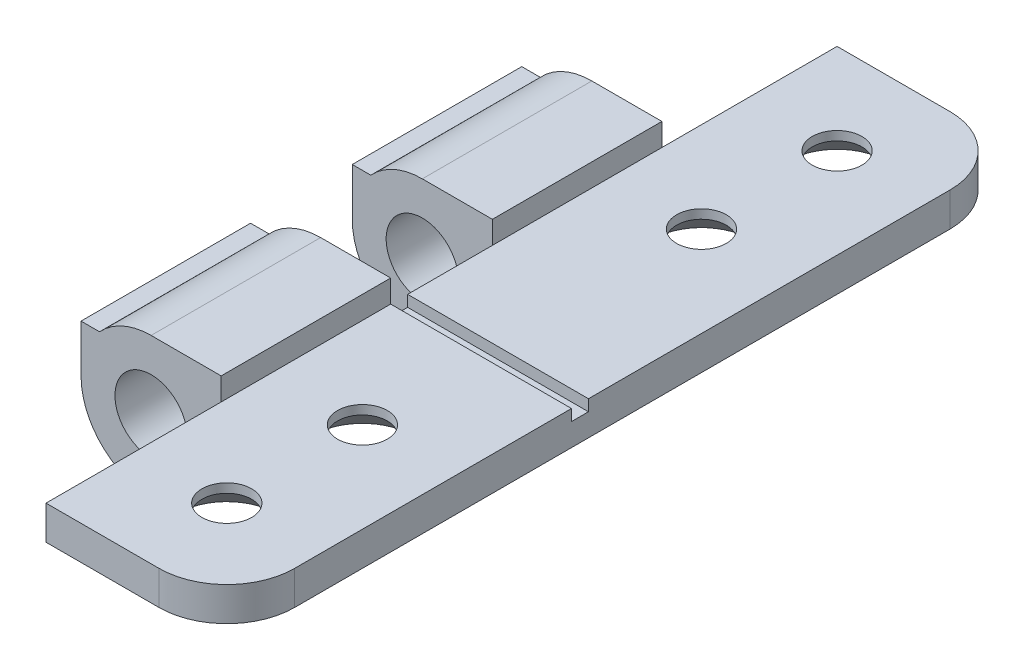
ISO-10303-21;
HEADER;
FILE_DESCRIPTION(('STEP AP214'),'2;1');
FILE_NAME('part.step','',(''),(''),'','','');
FILE_SCHEMA(('AUTOMOTIVE_DESIGN { 1 0 10303 214 1 1 1 1 }'));
ENDSEC;
DATA;
#1=APPLICATION_CONTEXT('core data for automotive mechanical design processes');
#2=APPLICATION_PROTOCOL_DEFINITION('international standard','automotive_design',2000,#1);
#3=PRODUCT_CONTEXT('',#1,'mechanical');
#4=PRODUCT('Part','Part','',(#3));
#5=PRODUCT_RELATED_PRODUCT_CATEGORY('part','',(#4));
#6=PRODUCT_DEFINITION_FORMATION('','',#4);
#7=PRODUCT_DEFINITION_CONTEXT('part definition',#1,'design');
#8=PRODUCT_DEFINITION('design','',#6,#7);
#9=PRODUCT_DEFINITION_SHAPE('','',#8);
#10=(LENGTH_UNIT() NAMED_UNIT(*) SI_UNIT(.MILLI.,.METRE.));
#11=(NAMED_UNIT(*) PLANE_ANGLE_UNIT() SI_UNIT($,.RADIAN.));
#12=(NAMED_UNIT(*) SI_UNIT($,.STERADIAN.) SOLID_ANGLE_UNIT());
#13=UNCERTAINTY_MEASURE_WITH_UNIT(LENGTH_MEASURE(1.E-05),#10,'distance_accuracy_value','');
#14=(GEOMETRIC_REPRESENTATION_CONTEXT(3) GLOBAL_UNCERTAINTY_ASSIGNED_CONTEXT((#13)) GLOBAL_UNIT_ASSIGNED_CONTEXT((#10,
#11,#12)) REPRESENTATION_CONTEXT('',''));
#15=CARTESIAN_POINT('',(0.,0.,0.));
#16=DIRECTION('',(0.,0.,1.));
#17=DIRECTION('',(1.,0.,0.));
#18=AXIS2_PLACEMENT_3D('',#15,#16,#17);
#19=CARTESIAN_POINT('',(3.1,2.1,7.5));
#20=DIRECTION('',(0.,-1.,0.));
#21=DIRECTION('',(0.,0.,-1.));
#22=AXIS2_PLACEMENT_3D('',#19,#20,#21);
#23=PLANE('',#22);
#24=CARTESIAN_POINT('',(7.1,2.1,23.25));
#25=DIRECTION('',(0.,-1.,0.));
#26=DIRECTION('',(0.,0.,-1.));
#27=AXIS2_PLACEMENT_3D('',#24,#25,#26);
#28=CIRCLE('',#27,1.1);
#29=CARTESIAN_POINT('',(7.1,2.1,22.15));
#30=VERTEX_POINT('',#29);
#31=EDGE_CURVE('E252',#30,#30,#28,.T.);
#32=ORIENTED_EDGE('',*,*,#31,.T.);
#33=EDGE_LOOP('',(#32));
#34=FACE_BOUND('',#33,.T.);
#35=CARTESIAN_POINT('',(7.1,2.1,17.25));
#36=DIRECTION('',(0.,-1.,0.));
#37=DIRECTION('',(0.,0.,-1.));
#38=AXIS2_PLACEMENT_3D('',#35,#36,#37);
#39=CIRCLE('',#38,1.1);
#40=CARTESIAN_POINT('',(7.1,2.1,16.15));
#41=VERTEX_POINT('',#40);
#42=EDGE_CURVE('E505',#41,#41,#39,.T.);
#43=ORIENTED_EDGE('',*,*,#42,.T.);
#44=EDGE_LOOP('',(#43));
#45=FACE_BOUND('',#44,.T.);
#46=DIRECTION('',(-1.,0.,0.));
#47=VECTOR('',#46,1.);
#48=CARTESIAN_POINT('',(11.1,2.1,27.25));
#49=LINE('',#48,#47);
#50=CARTESIAN_POINT('',(8.1,2.1,27.25));
#51=VERTEX_POINT('',#50);
#52=CARTESIAN_POINT('',(3.1,2.1,27.25));
#53=VERTEX_POINT('',#52);
#54=EDGE_CURVE('E290',#51,#53,#49,.T.);
#55=ORIENTED_EDGE('',*,*,#54,.F.);
#56=CARTESIAN_POINT('',(8.1,2.1,24.25));
#57=DIRECTION('',(0.,-1.,0.));
#58=DIRECTION('',(0.,0.,-1.));
#59=AXIS2_PLACEMENT_3D('',#56,#57,#58);
#60=CIRCLE('',#59,3.);
#61=CARTESIAN_POINT('',(11.1,2.1,24.25));
#62=VERTEX_POINT('',#61);
#63=EDGE_CURVE('E218',#51,#62,#60,.F.);
#64=ORIENTED_EDGE('',*,*,#63,.T.);
#65=DIRECTION('',(0.,0.,-1.));
#66=VECTOR('',#65,1.);
#67=CARTESIAN_POINT('',(11.1,2.1,7.5));
#68=LINE('',#67,#66);
#69=CARTESIAN_POINT('',(11.1,2.1,12.));
#70=VERTEX_POINT('',#69);
#71=EDGE_CURVE('E212',#62,#70,#68,.T.);
#72=ORIENTED_EDGE('',*,*,#71,.T.);
#73=DIRECTION('',(-1.,0.,0.));
#74=VECTOR('',#73,1.);
#75=CARTESIAN_POINT('',(11.1,2.1,12.));
#76=LINE('',#75,#74);
#77=CARTESIAN_POINT('',(3.1,2.1,12.));
#78=VERTEX_POINT('',#77);
#79=EDGE_CURVE('E216',#70,#78,#76,.T.);
#80=ORIENTED_EDGE('',*,*,#79,.T.);
#81=DIRECTION('',(0.,0.,-1.));
#82=VECTOR('',#81,1.);
#83=CARTESIAN_POINT('',(3.1,2.1,19.5));
#84=LINE('',#83,#82);
#85=CARTESIAN_POINT('',(3.1,2.1,19.5));
#86=VERTEX_POINT('',#85);
#87=EDGE_CURVE('E390',#86,#78,#84,.T.);
#88=ORIENTED_EDGE('',*,*,#87,.F.);
#89=DIRECTION('',(0.,0.,-1.));
#90=VECTOR('',#89,1.);
#91=CARTESIAN_POINT('',(3.1,2.1,27.25));
#92=LINE('',#91,#90);
#93=EDGE_CURVE('E307',#53,#86,#92,.T.);
#94=ORIENTED_EDGE('',*,*,#93,.F.);
#95=EDGE_LOOP('',(#55,#64,#72,#80,#88,#94));
#96=FACE_BOUND('',#95,.T.);
#97=ADVANCED_FACE('F41',(#34,#45,#96),#23,.F.);
#98=CARTESIAN_POINT('',(0.,0.,0.));
#99=DIRECTION('',(0.,0.,1.));
#100=DIRECTION('',(1.,0.,0.));
#101=AXIS2_PLACEMENT_3D('',#98,#99,#100);
#102=PLANE('',#101);
#103=CARTESIAN_POINT('',(0.,0.,0.));
#104=DIRECTION('',(0.,0.,1.));
#105=DIRECTION('',(1.,0.,0.));
#106=AXIS2_PLACEMENT_3D('',#103,#104,#105);
#107=CIRCLE('',#106,1.6);
#108=CARTESIAN_POINT('',(1.6,0.,0.));
#109=VERTEX_POINT('',#108);
#110=EDGE_CURVE('E407',#109,#109,#107,.T.);
#111=ORIENTED_EDGE('',*,*,#110,.T.);
#112=EDGE_LOOP('',(#111));
#113=FACE_BOUND('',#112,.T.);
#114=DIRECTION('',(0.,1.,0.));
#115=VECTOR('',#114,1.);
#116=CARTESIAN_POINT('',(3.1,0.599999999999999,0.));
#117=LINE('',#116,#115);
#118=CARTESIAN_POINT('',(3.1,0.599999999999999,0.));
#119=VERTEX_POINT('',#118);
#120=CARTESIAN_POINT('',(3.1,2.1,0.));
#121=VERTEX_POINT('',#120);
#122=EDGE_CURVE('E263',#119,#121,#117,.T.);
#123=ORIENTED_EDGE('',*,*,#122,.F.);
#124=DIRECTION('',(0.,1.,0.));
#125=VECTOR('',#124,1.);
#126=CARTESIAN_POINT('',(3.1,0.,0.));
#127=LINE('',#126,#125);
#128=CARTESIAN_POINT('',(3.1,0.,0.));
#129=VERTEX_POINT('',#128);
#130=EDGE_CURVE('E421',#129,#119,#127,.T.);
#131=ORIENTED_EDGE('',*,*,#130,.F.);
#132=CARTESIAN_POINT('',(0.,0.,0.));
#133=DIRECTION('',(0.,0.,1.));
#134=DIRECTION('',(1.,0.,0.));
#135=AXIS2_PLACEMENT_3D('',#132,#133,#134);
#136=CIRCLE('',#135,3.1);
#137=CARTESIAN_POINT('',(-3.1,0.,0.));
#138=VERTEX_POINT('',#137);
#139=EDGE_CURVE('E456',#138,#129,#136,.T.);
#140=ORIENTED_EDGE('',*,*,#139,.F.);
#141=DIRECTION('',(0.,-1.,0.));
#142=VECTOR('',#141,1.);
#143=CARTESIAN_POINT('',(-3.1,0.,0.));
#144=LINE('',#143,#142);
#145=CARTESIAN_POINT('',(-3.1,2.1,0.));
#146=VERTEX_POINT('',#145);
#147=EDGE_CURVE('E453',#146,#138,#144,.T.);
#148=ORIENTED_EDGE('',*,*,#147,.F.);
#149=DIRECTION('',(-1.,0.,0.));
#150=VECTOR('',#149,1.);
#151=CARTESIAN_POINT('',(-3.1,2.1,0.));
#152=LINE('',#151,#150);
#153=CARTESIAN_POINT('',(-2.28035085019828,2.1,0.));
#154=VERTEX_POINT('',#153);
#155=EDGE_CURVE('E450',#154,#146,#152,.T.);
#156=ORIENTED_EDGE('',*,*,#155,.F.);
#157=CARTESIAN_POINT('',(0.,0.,0.));
#158=DIRECTION('',(0.,0.,1.));
#159=DIRECTION('',(1.,0.,0.));
#160=AXIS2_PLACEMENT_3D('',#157,#158,#159);
#161=CIRCLE('',#160,3.1);
#162=CARTESIAN_POINT('',(0.,3.1,0.));
#163=VERTEX_POINT('',#162);
#164=EDGE_CURVE('E447',#163,#154,#161,.T.);
#165=ORIENTED_EDGE('',*,*,#164,.F.);
#166=DIRECTION('',(-1.,0.,0.));
#167=VECTOR('',#166,1.);
#168=CARTESIAN_POINT('',(3.1,3.1,0.));
#169=LINE('',#168,#167);
#170=CARTESIAN_POINT('',(3.1,3.1,0.));
#171=VERTEX_POINT('',#170);
#172=EDGE_CURVE('E444',#171,#163,#169,.T.);
#173=ORIENTED_EDGE('',*,*,#172,.F.);
#174=DIRECTION('',(0.,1.,0.));
#175=VECTOR('',#174,1.);
#176=CARTESIAN_POINT('',(3.1,2.1,0.));
#177=LINE('',#176,#175);
#178=EDGE_CURVE('E412',#121,#171,#177,.T.);
#179=ORIENTED_EDGE('',*,*,#178,.F.);
#180=EDGE_LOOP('',(#123,#131,#140,#148,#156,#165,#173,#179));
#181=FACE_BOUND('',#180,.T.);
#182=ADVANCED_FACE('F584',(#113,#181),#102,.F.);
#183=CARTESIAN_POINT('',(0.,0.,7.5));
#184=DIRECTION('',(0.,0.,1.));
#185=DIRECTION('',(1.,0.,0.));
#186=AXIS2_PLACEMENT_3D('',#183,#184,#185);
#187=PLANE('',#186);
#188=DIRECTION('',(0.,-1.,0.));
#189=VECTOR('',#188,1.);
#190=CARTESIAN_POINT('',(3.1,2.1,7.5));
#191=LINE('',#190,#189);
#192=CARTESIAN_POINT('',(3.1,2.1,7.5));
#193=VERTEX_POINT('',#192);
#194=CARTESIAN_POINT('',(3.1,0.599999999999999,7.5));
#195=VERTEX_POINT('',#194);
#196=EDGE_CURVE('E393',#193,#195,#191,.T.);
#197=ORIENTED_EDGE('',*,*,#196,.F.);
#198=DIRECTION('',(0.,1.,0.));
#199=VECTOR('',#198,1.);
#200=CARTESIAN_POINT('',(3.1,2.1,7.5));
#201=LINE('',#200,#199);
#202=CARTESIAN_POINT('',(3.1,3.1,7.5));
#203=VERTEX_POINT('',#202);
#204=EDGE_CURVE('E416',#193,#203,#201,.T.);
#205=ORIENTED_EDGE('',*,*,#204,.T.);
#206=DIRECTION('',(-1.,0.,0.));
#207=VECTOR('',#206,1.);
#208=CARTESIAN_POINT('',(3.1,3.1,7.5));
#209=LINE('',#208,#207);
#210=CARTESIAN_POINT('',(0.,3.1,7.5));
#211=VERTEX_POINT('',#210);
#212=EDGE_CURVE('E420',#203,#211,#209,.T.);
#213=ORIENTED_EDGE('',*,*,#212,.T.);
#214=CARTESIAN_POINT('',(0.,0.,7.5));
#215=DIRECTION('',(0.,0.,1.));
#216=DIRECTION('',(1.,0.,0.));
#217=AXIS2_PLACEMENT_3D('',#214,#215,#216);
#218=CIRCLE('',#217,3.1);
#219=CARTESIAN_POINT('',(-2.28035085019828,2.1,7.5));
#220=VERTEX_POINT('',#219);
#221=EDGE_CURVE('E424',#211,#220,#218,.T.);
#222=ORIENTED_EDGE('',*,*,#221,.T.);
#223=DIRECTION('',(-1.,0.,0.));
#224=VECTOR('',#223,1.);
#225=CARTESIAN_POINT('',(-3.1,2.1,7.5));
#226=LINE('',#225,#224);
#227=CARTESIAN_POINT('',(-3.1,2.1,7.5));
#228=VERTEX_POINT('',#227);
#229=EDGE_CURVE('E427',#220,#228,#226,.T.);
#230=ORIENTED_EDGE('',*,*,#229,.T.);
#231=DIRECTION('',(0.,-1.,0.));
#232=VECTOR('',#231,1.);
#233=CARTESIAN_POINT('',(-3.1,0.,7.5));
#234=LINE('',#233,#232);
#235=CARTESIAN_POINT('',(-3.1,0.,7.5));
#236=VERTEX_POINT('',#235);
#237=EDGE_CURVE('E430',#228,#236,#234,.T.);
#238=ORIENTED_EDGE('',*,*,#237,.T.);
#239=CARTESIAN_POINT('',(0.,0.,7.5));
#240=DIRECTION('',(0.,0.,1.));
#241=DIRECTION('',(1.,0.,0.));
#242=AXIS2_PLACEMENT_3D('',#239,#240,#241);
#243=CIRCLE('',#242,3.1);
#244=CARTESIAN_POINT('',(3.1,0.,7.5));
#245=VERTEX_POINT('',#244);
#246=EDGE_CURVE('E433',#236,#245,#243,.T.);
#247=ORIENTED_EDGE('',*,*,#246,.T.);
#248=DIRECTION('',(0.,1.,0.));
#249=VECTOR('',#248,1.);
#250=CARTESIAN_POINT('',(3.1,0.,7.5));
#251=LINE('',#250,#249);
#252=EDGE_CURVE('E436',#245,#195,#251,.T.);
#253=ORIENTED_EDGE('',*,*,#252,.T.);
#254=EDGE_LOOP('',(#197,#205,#213,#222,#230,#238,#247,#253));
#255=FACE_BOUND('',#254,.T.);
#256=CARTESIAN_POINT('',(0.,0.,7.5));
#257=DIRECTION('',(0.,0.,1.));
#258=DIRECTION('',(1.,0.,0.));
#259=AXIS2_PLACEMENT_3D('',#256,#257,#258);
#260=CIRCLE('',#259,1.6);
#261=CARTESIAN_POINT('',(1.6,0.,7.5));
#262=VERTEX_POINT('',#261);
#263=EDGE_CURVE('E408',#262,#262,#260,.T.);
#264=ORIENTED_EDGE('',*,*,#263,.F.);
#265=EDGE_LOOP('',(#264));
#266=FACE_BOUND('',#265,.T.);
#267=ADVANCED_FACE('F589',(#255,#266),#187,.T.);
#268=CARTESIAN_POINT('',(3.1,2.1,7.5));
#269=DIRECTION('',(-1.,0.,0.));
#270=DIRECTION('',(0.,0.,1.));
#271=AXIS2_PLACEMENT_3D('',#268,#269,#270);
#272=PLANE('',#271);
#273=ORIENTED_EDGE('',*,*,#178,.T.);
#274=DIRECTION('',(0.,0.,-1.));
#275=VECTOR('',#274,1.);
#276=CARTESIAN_POINT('',(3.1,3.1,7.5));
#277=LINE('',#276,#275);
#278=EDGE_CURVE('E492',#203,#171,#277,.T.);
#279=ORIENTED_EDGE('',*,*,#278,.F.);
#280=ORIENTED_EDGE('',*,*,#204,.F.);
#281=DIRECTION('',(0.,0.,-1.));
#282=VECTOR('',#281,1.);
#283=CARTESIAN_POINT('',(3.1,2.1,7.5));
#284=LINE('',#283,#282);
#285=EDGE_CURVE('E440',#193,#121,#284,.T.);
#286=ORIENTED_EDGE('',*,*,#285,.T.);
#287=EDGE_LOOP('',(#273,#279,#280,#286));
#288=FACE_BOUND('',#287,.T.);
#289=ADVANCED_FACE('F682',(#288),#272,.F.);
#290=CARTESIAN_POINT('',(3.1,3.1,7.5));
#291=DIRECTION('',(0.,-1.,0.));
#292=DIRECTION('',(1.,0.,0.));
#293=AXIS2_PLACEMENT_3D('',#290,#291,#292);
#294=PLANE('',#293);
#295=ORIENTED_EDGE('',*,*,#172,.T.);
#296=DIRECTION('',(0.,0.,-1.));
#297=VECTOR('',#296,1.);
#298=CARTESIAN_POINT('',(0.,3.1,7.5));
#299=LINE('',#298,#297);
#300=EDGE_CURVE('E488',#211,#163,#299,.T.);
#301=ORIENTED_EDGE('',*,*,#300,.F.);
#302=ORIENTED_EDGE('',*,*,#212,.F.);
#303=ORIENTED_EDGE('',*,*,#278,.T.);
#304=EDGE_LOOP('',(#295,#301,#302,#303));
#305=FACE_BOUND('',#304,.T.);
#306=ADVANCED_FACE('F687',(#305),#294,.F.);
#307=CARTESIAN_POINT('',(0.,0.,7.5));
#308=DIRECTION('',(0.,0.,-1.));
#309=DIRECTION('',(-1.,0.,0.));
#310=AXIS2_PLACEMENT_3D('',#307,#308,#309);
#311=CYLINDRICAL_SURFACE('',#310,3.1);
#312=ORIENTED_EDGE('',*,*,#164,.T.);
#313=DIRECTION('',(0.,0.,-1.));
#314=VECTOR('',#313,1.);
#315=CARTESIAN_POINT('',(-2.28035085019828,2.1,7.5));
#316=LINE('',#315,#314);
#317=EDGE_CURVE('E484',#220,#154,#316,.T.);
#318=ORIENTED_EDGE('',*,*,#317,.F.);
#319=ORIENTED_EDGE('',*,*,#221,.F.);
#320=ORIENTED_EDGE('',*,*,#300,.T.);
#321=EDGE_LOOP('',(#312,#318,#319,#320));
#322=FACE_BOUND('',#321,.T.);
#323=ADVANCED_FACE('F719',(#322),#311,.T.);
#324=CARTESIAN_POINT('',(-3.1,2.1,7.5));
#325=DIRECTION('',(0.,-1.,0.));
#326=DIRECTION('',(0.,0.,-1.));
#327=AXIS2_PLACEMENT_3D('',#324,#325,#326);
#328=PLANE('',#327);
#329=ORIENTED_EDGE('',*,*,#155,.T.);
#330=DIRECTION('',(0.,0.,-1.));
#331=VECTOR('',#330,1.);
#332=CARTESIAN_POINT('',(-3.1,2.1,7.5));
#333=LINE('',#332,#331);
#334=EDGE_CURVE('E480',#228,#146,#333,.T.);
#335=ORIENTED_EDGE('',*,*,#334,.F.);
#336=ORIENTED_EDGE('',*,*,#229,.F.);
#337=ORIENTED_EDGE('',*,*,#317,.T.);
#338=EDGE_LOOP('',(#329,#335,#336,#337));
#339=FACE_BOUND('',#338,.T.);
#340=ADVANCED_FACE('F715',(#339),#328,.F.);
#341=CARTESIAN_POINT('',(-3.1,0.,7.5));
#342=DIRECTION('',(1.,0.,0.));
#343=DIRECTION('',(0.,0.,-1.));
#344=AXIS2_PLACEMENT_3D('',#341,#342,#343);
#345=PLANE('',#344);
#346=ORIENTED_EDGE('',*,*,#147,.T.);
#347=DIRECTION('',(0.,0.,-1.));
#348=VECTOR('',#347,1.);
#349=CARTESIAN_POINT('',(-3.1,0.,7.5));
#350=LINE('',#349,#348);
#351=EDGE_CURVE('E476',#236,#138,#350,.T.);
#352=ORIENTED_EDGE('',*,*,#351,.F.);
#353=ORIENTED_EDGE('',*,*,#237,.F.);
#354=ORIENTED_EDGE('',*,*,#334,.T.);
#355=EDGE_LOOP('',(#346,#352,#353,#354));
#356=FACE_BOUND('',#355,.T.);
#357=ADVANCED_FACE('F710',(#356),#345,.F.);
#358=CARTESIAN_POINT('',(0.,0.,7.5));
#359=DIRECTION('',(0.,0.,-1.));
#360=DIRECTION('',(-1.,0.,0.));
#361=AXIS2_PLACEMENT_3D('',#358,#359,#360);
#362=CYLINDRICAL_SURFACE('',#361,3.1);
#363=ORIENTED_EDGE('',*,*,#139,.T.);
#364=DIRECTION('',(0.,0.,-1.));
#365=VECTOR('',#364,1.);
#366=CARTESIAN_POINT('',(3.1,0.,7.5));
#367=LINE('',#366,#365);
#368=EDGE_CURVE('E472',#245,#129,#367,.T.);
#369=ORIENTED_EDGE('',*,*,#368,.F.);
#370=ORIENTED_EDGE('',*,*,#246,.F.);
#371=ORIENTED_EDGE('',*,*,#351,.T.);
#372=EDGE_LOOP('',(#363,#369,#370,#371));
#373=FACE_BOUND('',#372,.T.);
#374=ADVANCED_FACE('F704',(#373),#362,.T.);
#375=CARTESIAN_POINT('',(3.1,0.,7.5));
#376=DIRECTION('',(-1.,0.,0.));
#377=DIRECTION('',(0.,0.,1.));
#378=AXIS2_PLACEMENT_3D('',#375,#376,#377);
#379=PLANE('',#378);
#380=ORIENTED_EDGE('',*,*,#130,.T.);
#381=DIRECTION('',(0.,0.,-1.));
#382=VECTOR('',#381,1.);
#383=CARTESIAN_POINT('',(3.1,0.599999999999999,7.5));
#384=LINE('',#383,#382);
#385=EDGE_CURVE('E468',#195,#119,#384,.T.);
#386=ORIENTED_EDGE('',*,*,#385,.F.);
#387=ORIENTED_EDGE('',*,*,#252,.F.);
#388=ORIENTED_EDGE('',*,*,#368,.T.);
#389=EDGE_LOOP('',(#380,#386,#387,#388));
#390=FACE_BOUND('',#389,.T.);
#391=ADVANCED_FACE('F699',(#390),#379,.F.);
#392=CARTESIAN_POINT('',(11.1,0.6,7.5));
#393=DIRECTION('',(0.,1.,0.));
#394=DIRECTION('',(-1.,0.,0.));
#395=AXIS2_PLACEMENT_3D('',#392,#393,#394);
#396=PLANE('',#395);
#397=CARTESIAN_POINT('',(7.1,0.6,-3.75));
#398=DIRECTION('',(0.,1.,0.));
#399=DIRECTION('',(-1.,0.,0.));
#400=AXIS2_PLACEMENT_3D('',#397,#398,#399);
#401=CIRCLE('',#400,2.2);
#402=CARTESIAN_POINT('',(4.9,0.6,-3.75));
#403=VERTEX_POINT('',#402);
#404=EDGE_CURVE('E521',#403,#403,#401,.T.);
#405=ORIENTED_EDGE('',*,*,#404,.T.);
#406=EDGE_LOOP('',(#405));
#407=FACE_BOUND('',#406,.T.);
#408=CARTESIAN_POINT('',(7.1,0.6,2.25));
#409=DIRECTION('',(0.,1.,0.));
#410=DIRECTION('',(-1.,0.,0.));
#411=AXIS2_PLACEMENT_3D('',#408,#409,#410);
#412=CIRCLE('',#411,2.20000000000002);
#413=CARTESIAN_POINT('',(4.89999999999998,0.6,2.25));
#414=VERTEX_POINT('',#413);
#415=EDGE_CURVE('E517',#414,#414,#412,.T.);
#416=ORIENTED_EDGE('',*,*,#415,.T.);
#417=EDGE_LOOP('',(#416));
#418=FACE_BOUND('',#417,.T.);
#419=CARTESIAN_POINT('',(7.1,0.6,23.25));
#420=DIRECTION('',(0.,1.,0.));
#421=DIRECTION('',(-1.,0.,0.));
#422=AXIS2_PLACEMENT_3D('',#419,#420,#421);
#423=CIRCLE('',#422,2.20000000000002);
#424=CARTESIAN_POINT('',(4.89999999999997,0.6,23.25));
#425=VERTEX_POINT('',#424);
#426=EDGE_CURVE('E513',#425,#425,#423,.T.);
#427=ORIENTED_EDGE('',*,*,#426,.T.);
#428=EDGE_LOOP('',(#427));
#429=FACE_BOUND('',#428,.T.);
#430=CARTESIAN_POINT('',(7.1,0.6,17.25));
#431=DIRECTION('',(0.,1.,0.));
#432=DIRECTION('',(-1.,0.,0.));
#433=AXIS2_PLACEMENT_3D('',#430,#431,#432);
#434=CIRCLE('',#433,2.20000000000002);
#435=CARTESIAN_POINT('',(4.89999999999997,0.6,17.25));
#436=VERTEX_POINT('',#435);
#437=EDGE_CURVE('E509',#436,#436,#434,.T.);
#438=ORIENTED_EDGE('',*,*,#437,.T.);
#439=EDGE_LOOP('',(#438));
#440=FACE_BOUND('',#439,.T.);
#441=DIRECTION('',(0.,0.,-1.));
#442=VECTOR('',#441,1.);
#443=CARTESIAN_POINT('',(11.1,0.6,7.5));
#444=LINE('',#443,#442);
#445=CARTESIAN_POINT('',(11.1,0.6,24.25));
#446=VERTEX_POINT('',#445);
#447=CARTESIAN_POINT('',(11.1,0.6,-4.75));
#448=VERTEX_POINT('',#447);
#449=EDGE_CURVE('E223',#446,#448,#444,.T.);
#450=ORIENTED_EDGE('',*,*,#449,.F.);
#451=CARTESIAN_POINT('',(8.1,0.6,24.25));
#452=DIRECTION('',(0.,1.,0.));
#453=DIRECTION('',(-1.,0.,0.));
#454=AXIS2_PLACEMENT_3D('',#451,#452,#453);
#455=CIRCLE('',#454,3.);
#456=CARTESIAN_POINT('',(8.1,0.6,27.25));
#457=VERTEX_POINT('',#456);
#458=EDGE_CURVE('E551',#446,#457,#455,.F.);
#459=ORIENTED_EDGE('',*,*,#458,.T.);
#460=DIRECTION('',(1.,0.,0.));
#461=VECTOR('',#460,1.);
#462=CARTESIAN_POINT('',(11.1,0.6,27.25));
#463=LINE('',#462,#461);
#464=CARTESIAN_POINT('',(3.1,0.599999999999999,27.25));
#465=VERTEX_POINT('',#464);
#466=EDGE_CURVE('E296',#465,#457,#463,.T.);
#467=ORIENTED_EDGE('',*,*,#466,.F.);
#468=DIRECTION('',(0.,0.,-1.));
#469=VECTOR('',#468,1.);
#470=CARTESIAN_POINT('',(3.1,0.599999999999999,27.25));
#471=LINE('',#470,#469);
#472=CARTESIAN_POINT('',(3.1,0.599999999999999,19.5));
#473=VERTEX_POINT('',#472);
#474=EDGE_CURVE('E300',#465,#473,#471,.T.);
#475=ORIENTED_EDGE('',*,*,#474,.T.);
#476=DIRECTION('',(0.,0.,-1.));
#477=VECTOR('',#476,1.);
#478=CARTESIAN_POINT('',(3.1,0.599999999999999,19.5));
#479=LINE('',#478,#477);
#480=CARTESIAN_POINT('',(3.1,0.599999999999999,12.));
#481=VERTEX_POINT('',#480);
#482=EDGE_CURVE('E342',#473,#481,#479,.T.);
#483=ORIENTED_EDGE('',*,*,#482,.T.);
#484=DIRECTION('',(0.,0.,-1.));
#485=VECTOR('',#484,1.);
#486=CARTESIAN_POINT('',(3.1,0.599999999999999,12.));
#487=LINE('',#486,#485);
#488=EDGE_CURVE('E397',#481,#195,#487,.T.);
#489=ORIENTED_EDGE('',*,*,#488,.T.);
#490=ORIENTED_EDGE('',*,*,#385,.T.);
#491=DIRECTION('',(0.,0.,1.));
#492=VECTOR('',#491,1.);
#493=CARTESIAN_POINT('',(3.1,0.599999999999999,-7.75));
#494=LINE('',#493,#492);
#495=CARTESIAN_POINT('',(3.1,0.599999999999999,-7.75));
#496=VERTEX_POINT('',#495);
#497=EDGE_CURVE('E285',#496,#119,#494,.T.);
#498=ORIENTED_EDGE('',*,*,#497,.F.);
#499=DIRECTION('',(-1.,0.,0.));
#500=VECTOR('',#499,1.);
#501=CARTESIAN_POINT('',(11.1,0.6,-7.75));
#502=LINE('',#501,#500);
#503=CARTESIAN_POINT('',(8.1,0.6,-7.75));
#504=VERTEX_POINT('',#503);
#505=EDGE_CURVE('E269',#504,#496,#502,.T.);
#506=ORIENTED_EDGE('',*,*,#505,.F.);
#507=CARTESIAN_POINT('',(8.1,0.6,-4.75));
#508=DIRECTION('',(0.,1.,0.));
#509=DIRECTION('',(-1.,0.,0.));
#510=AXIS2_PLACEMENT_3D('',#507,#508,#509);
#511=CIRCLE('',#510,3.);
#512=EDGE_CURVE('E63',#504,#448,#511,.F.);
#513=ORIENTED_EDGE('',*,*,#512,.T.);
#514=EDGE_LOOP('',(#450,#459,#467,#475,#483,#489,#490,#498,#506,#513));
#515=FACE_BOUND('',#514,.T.);
#516=ADVANCED_FACE('F561',(#407,#418,#429,#440,#515),#396,.F.);
#517=CARTESIAN_POINT('',(11.1,2.1,7.5));
#518=DIRECTION('',(-1.,0.,0.));
#519=DIRECTION('',(0.,0.,1.));
#520=AXIS2_PLACEMENT_3D('',#517,#518,#519);
#521=PLANE('',#520);
#522=ORIENTED_EDGE('',*,*,#71,.F.);
#523=DIRECTION('',(0.,1.,0.));
#524=VECTOR('',#523,1.);
#525=CARTESIAN_POINT('',(11.1,0.6,24.25));
#526=LINE('',#525,#524);
#527=EDGE_CURVE('E546',#62,#446,#526,.F.);
#528=ORIENTED_EDGE('',*,*,#527,.T.);
#529=ORIENTED_EDGE('',*,*,#449,.T.);
#530=DIRECTION('',(0.,-1.,0.));
#531=VECTOR('',#530,1.);
#532=CARTESIAN_POINT('',(11.1,2.1,-4.75));
#533=LINE('',#532,#531);
#534=CARTESIAN_POINT('',(11.1,2.1,-4.75));
#535=VERTEX_POINT('',#534);
#536=EDGE_CURVE('E543',#448,#535,#533,.F.);
#537=ORIENTED_EDGE('',*,*,#536,.T.);
#538=CARTESIAN_POINT('',(11.1,2.1,11.25));
#539=VERTEX_POINT('',#538);
#540=EDGE_CURVE('E224',#539,#535,#68,.T.);
#541=ORIENTED_EDGE('',*,*,#540,.F.);
#542=DIRECTION('',(0.,-1.,0.));
#543=VECTOR('',#542,1.);
#544=CARTESIAN_POINT('',(11.1,2.1,11.25));
#545=LINE('',#544,#543);
#546=CARTESIAN_POINT('',(11.1,1.6,11.25));
#547=VERTEX_POINT('',#546);
#548=EDGE_CURVE('E243',#539,#547,#545,.T.);
#549=ORIENTED_EDGE('',*,*,#548,.T.);
#550=DIRECTION('',(0.,0.,1.));
#551=VECTOR('',#550,1.);
#552=CARTESIAN_POINT('',(11.1,1.6,12.));
#553=LINE('',#552,#551);
#554=CARTESIAN_POINT('',(11.1,1.6,12.));
#555=VERTEX_POINT('',#554);
#556=EDGE_CURVE('E237',#547,#555,#553,.T.);
#557=ORIENTED_EDGE('',*,*,#556,.T.);
#558=DIRECTION('',(0.,1.,0.));
#559=VECTOR('',#558,1.);
#560=CARTESIAN_POINT('',(11.1,2.1,12.));
#561=LINE('',#560,#559);
#562=EDGE_CURVE('E231',#555,#70,#561,.T.);
#563=ORIENTED_EDGE('',*,*,#562,.T.);
#564=EDGE_LOOP('',(#522,#528,#529,#537,#541,#549,#557,#563));
#565=FACE_BOUND('',#564,.T.);
#566=ADVANCED_FACE('F239',(#565),#521,.F.);
#567=CARTESIAN_POINT('',(7.1,2.1,2.25));
#568=DIRECTION('',(0.,-1.,0.));
#569=DIRECTION('',(0.,0.,-1.));
#570=AXIS2_PLACEMENT_3D('',#567,#568,#569);
#571=CIRCLE('',#570,1.10000000000001);
#572=CARTESIAN_POINT('',(7.1,2.1,1.15));
#573=VERTEX_POINT('',#572);
#574=EDGE_CURVE('E501',#573,#573,#571,.T.);
#575=ORIENTED_EDGE('',*,*,#574,.T.);
#576=EDGE_LOOP('',(#575));
#577=FACE_BOUND('',#576,.T.);
#578=CARTESIAN_POINT('',(7.1,2.1,-3.75));
#579=DIRECTION('',(0.,-1.,0.));
#580=DIRECTION('',(0.,0.,-1.));
#581=AXIS2_PLACEMENT_3D('',#578,#579,#580);
#582=CIRCLE('',#581,1.1);
#583=CARTESIAN_POINT('',(7.1,2.1,-4.85));
#584=VERTEX_POINT('',#583);
#585=EDGE_CURVE('E497',#584,#584,#582,.T.);
#586=ORIENTED_EDGE('',*,*,#585,.T.);
#587=EDGE_LOOP('',(#586));
#588=FACE_BOUND('',#587,.T.);
#589=ORIENTED_EDGE('',*,*,#540,.T.);
#590=CARTESIAN_POINT('',(8.1,2.1,-4.75));
#591=DIRECTION('',(0.,-1.,0.));
#592=DIRECTION('',(0.,0.,-1.));
#593=AXIS2_PLACEMENT_3D('',#590,#591,#592);
#594=CIRCLE('',#593,3.);
#595=CARTESIAN_POINT('',(8.1,2.1,-7.75));
#596=VERTEX_POINT('',#595);
#597=EDGE_CURVE('E11',#535,#596,#594,.F.);
#598=ORIENTED_EDGE('',*,*,#597,.T.);
#599=DIRECTION('',(1.,0.,0.));
#600=VECTOR('',#599,1.);
#601=CARTESIAN_POINT('',(3.1,2.1,-7.75));
#602=LINE('',#601,#600);
#603=CARTESIAN_POINT('',(3.1,2.1,-7.75));
#604=VERTEX_POINT('',#603);
#605=EDGE_CURVE('E275',#604,#596,#602,.T.);
#606=ORIENTED_EDGE('',*,*,#605,.F.);
#607=DIRECTION('',(0.,0.,1.));
#608=VECTOR('',#607,1.);
#609=CARTESIAN_POINT('',(3.1,2.1,-7.75));
#610=LINE('',#609,#608);
#611=EDGE_CURVE('E278',#604,#121,#610,.T.);
#612=ORIENTED_EDGE('',*,*,#611,.T.);
#613=ORIENTED_EDGE('',*,*,#285,.F.);
#614=DIRECTION('',(0.,0.,-1.));
#615=VECTOR('',#614,1.);
#616=CARTESIAN_POINT('',(3.1,2.1,12.));
#617=LINE('',#616,#615);
#618=CARTESIAN_POINT('',(3.1,2.1,11.25));
#619=VERTEX_POINT('',#618);
#620=EDGE_CURVE('E404',#619,#193,#617,.T.);
#621=ORIENTED_EDGE('',*,*,#620,.F.);
#622=DIRECTION('',(-1.,0.,0.));
#623=VECTOR('',#622,1.);
#624=CARTESIAN_POINT('',(11.1,2.1,11.25));
#625=LINE('',#624,#623);
#626=EDGE_CURVE('E236',#539,#619,#625,.T.);
#627=ORIENTED_EDGE('',*,*,#626,.F.);
#628=EDGE_LOOP('',(#589,#598,#606,#612,#613,#621,#627));
#629=FACE_BOUND('',#628,.T.);
#630=ADVANCED_FACE('F566',(#577,#588,#629),#23,.F.);
#631=CARTESIAN_POINT('',(0.,0.,7.5));
#632=DIRECTION('',(0.,0.,-1.));
#633=DIRECTION('',(-1.,0.,0.));
#634=AXIS2_PLACEMENT_3D('',#631,#632,#633);
#635=CYLINDRICAL_SURFACE('',#634,1.6);
#636=ORIENTED_EDGE('',*,*,#263,.T.);
#637=EDGE_LOOP('',(#636));
#638=FACE_BOUND('',#637,.T.);
#639=ORIENTED_EDGE('',*,*,#110,.F.);
#640=EDGE_LOOP('',(#639));
#641=FACE_BOUND('',#640,.T.);
#642=ADVANCED_FACE('F570',(#638,#641),#635,.F.);
#643=CARTESIAN_POINT('',(3.1,2.1,12.));
#644=DIRECTION('',(1.,0.,0.));
#645=DIRECTION('',(0.,0.,-1.));
#646=AXIS2_PLACEMENT_3D('',#643,#644,#645);
#647=PLANE('',#646);
#648=DIRECTION('',(0.,-1.,0.));
#649=VECTOR('',#648,1.);
#650=CARTESIAN_POINT('',(3.1,2.1,12.));
#651=LINE('',#650,#649);
#652=CARTESIAN_POINT('',(3.1,1.6,12.));
#653=VERTEX_POINT('',#652);
#654=EDGE_CURVE('E394',#653,#481,#651,.T.);
#655=ORIENTED_EDGE('',*,*,#654,.F.);
#656=DIRECTION('',(0.,0.,1.));
#657=VECTOR('',#656,1.);
#658=CARTESIAN_POINT('',(3.1,1.6,12.));
#659=LINE('',#658,#657);
#660=CARTESIAN_POINT('',(3.1,1.6,11.25));
#661=VERTEX_POINT('',#660);
#662=EDGE_CURVE('E244',#661,#653,#659,.T.);
#663=ORIENTED_EDGE('',*,*,#662,.F.);
#664=DIRECTION('',(0.,-1.,0.));
#665=VECTOR('',#664,1.);
#666=CARTESIAN_POINT('',(3.1,2.1,11.25));
#667=LINE('',#666,#665);
#668=EDGE_CURVE('E249',#619,#661,#667,.T.);
#669=ORIENTED_EDGE('',*,*,#668,.F.);
#670=ORIENTED_EDGE('',*,*,#620,.T.);
#671=ORIENTED_EDGE('',*,*,#196,.T.);
#672=ORIENTED_EDGE('',*,*,#488,.F.);
#673=EDGE_LOOP('',(#655,#663,#669,#670,#671,#672));
#674=FACE_BOUND('',#673,.T.);
#675=ADVANCED_FACE('F577',(#674),#647,.F.);
#676=CARTESIAN_POINT('',(0.,0.,12.));
#677=DIRECTION('',(0.,0.,1.));
#678=DIRECTION('',(1.,0.,0.));
#679=AXIS2_PLACEMENT_3D('',#676,#677,#678);
#680=PLANE('',#679);
#681=CARTESIAN_POINT('',(0.,0.,12.));
#682=DIRECTION('',(0.,0.,1.));
#683=DIRECTION('',(1.,0.,0.));
#684=AXIS2_PLACEMENT_3D('',#681,#682,#683);
#685=CIRCLE('',#684,1.6);
#686=CARTESIAN_POINT('',(1.6,0.,12.));
#687=VERTEX_POINT('',#686);
#688=EDGE_CURVE('E311',#687,#687,#685,.T.);
#689=ORIENTED_EDGE('',*,*,#688,.T.);
#690=EDGE_LOOP('',(#689));
#691=FACE_BOUND('',#690,.T.);
#692=DIRECTION('',(0.,1.,0.));
#693=VECTOR('',#692,1.);
#694=CARTESIAN_POINT('',(3.1,2.1,12.));
#695=LINE('',#694,#693);
#696=CARTESIAN_POINT('',(3.1,3.1,12.));
#697=VERTEX_POINT('',#696);
#698=EDGE_CURVE('E234',#78,#697,#695,.T.);
#699=ORIENTED_EDGE('',*,*,#698,.F.);
#700=ORIENTED_EDGE('',*,*,#79,.F.);
#701=ORIENTED_EDGE('',*,*,#562,.F.);
#702=DIRECTION('',(-1.,0.,0.));
#703=VECTOR('',#702,1.);
#704=CARTESIAN_POINT('',(11.1,1.6,12.));
#705=LINE('',#704,#703);
#706=EDGE_CURVE('E260',#555,#653,#705,.T.);
#707=ORIENTED_EDGE('',*,*,#706,.T.);
#708=ORIENTED_EDGE('',*,*,#654,.T.);
#709=DIRECTION('',(0.,1.,0.));
#710=VECTOR('',#709,1.);
#711=CARTESIAN_POINT('',(3.1,0.,12.));
#712=LINE('',#711,#710);
#713=CARTESIAN_POINT('',(3.1,0.,12.));
#714=VERTEX_POINT('',#713);
#715=EDGE_CURVE('E323',#714,#481,#712,.T.);
#716=ORIENTED_EDGE('',*,*,#715,.F.);
#717=CARTESIAN_POINT('',(0.,0.,12.));
#718=DIRECTION('',(0.,0.,1.));
#719=DIRECTION('',(1.,0.,0.));
#720=AXIS2_PLACEMENT_3D('',#717,#718,#719);
#721=CIRCLE('',#720,3.1);
#722=CARTESIAN_POINT('',(-3.1,0.,12.));
#723=VERTEX_POINT('',#722);
#724=EDGE_CURVE('E357',#723,#714,#721,.T.);
#725=ORIENTED_EDGE('',*,*,#724,.F.);
#726=DIRECTION('',(0.,-1.,0.));
#727=VECTOR('',#726,1.);
#728=CARTESIAN_POINT('',(-3.1,2.1,12.));
#729=LINE('',#728,#727);
#730=CARTESIAN_POINT('',(-3.1,2.1,12.));
#731=VERTEX_POINT('',#730);
#732=EDGE_CURVE('E354',#731,#723,#729,.T.);
#733=ORIENTED_EDGE('',*,*,#732,.F.);
#734=DIRECTION('',(-1.,0.,0.));
#735=VECTOR('',#734,1.);
#736=CARTESIAN_POINT('',(-2.28035085019828,2.1,12.));
#737=LINE('',#736,#735);
#738=CARTESIAN_POINT('',(-2.28035085019828,2.1,12.));
#739=VERTEX_POINT('',#738);
#740=EDGE_CURVE('E351',#739,#731,#737,.T.);
#741=ORIENTED_EDGE('',*,*,#740,.F.);
#742=CARTESIAN_POINT('',(0.,0.,12.));
#743=DIRECTION('',(0.,0.,1.));
#744=DIRECTION('',(1.,0.,0.));
#745=AXIS2_PLACEMENT_3D('',#742,#743,#744);
#746=CIRCLE('',#745,3.1);
#747=CARTESIAN_POINT('',(0.,3.1,12.));
#748=VERTEX_POINT('',#747);
#749=EDGE_CURVE('E348',#748,#739,#746,.T.);
#750=ORIENTED_EDGE('',*,*,#749,.F.);
#751=DIRECTION('',(-1.,0.,0.));
#752=VECTOR('',#751,1.);
#753=CARTESIAN_POINT('',(3.1,3.1,12.));
#754=LINE('',#753,#752);
#755=EDGE_CURVE('E345',#697,#748,#754,.T.);
#756=ORIENTED_EDGE('',*,*,#755,.F.);
#757=EDGE_LOOP('',(#699,#700,#701,#707,#708,#716,#725,#733,#741,#750,#756));
#758=FACE_BOUND('',#757,.T.);
#759=ADVANCED_FACE('F229',(#691,#758),#680,.F.);
#760=CARTESIAN_POINT('',(0.,0.,19.5));
#761=DIRECTION('',(0.,0.,1.));
#762=DIRECTION('',(1.,0.,0.));
#763=AXIS2_PLACEMENT_3D('',#760,#761,#762);
#764=PLANE('',#763);
#765=DIRECTION('',(0.,-1.,0.));
#766=VECTOR('',#765,1.);
#767=CARTESIAN_POINT('',(3.1,0.599999999999999,19.5));
#768=LINE('',#767,#766);
#769=EDGE_CURVE('E289',#86,#473,#768,.T.);
#770=ORIENTED_EDGE('',*,*,#769,.F.);
#771=DIRECTION('',(0.,1.,0.));
#772=VECTOR('',#771,1.);
#773=CARTESIAN_POINT('',(3.1,2.1,19.5));
#774=LINE('',#773,#772);
#775=CARTESIAN_POINT('',(3.1,3.1,19.5));
#776=VERTEX_POINT('',#775);
#777=EDGE_CURVE('E319',#86,#776,#774,.T.);
#778=ORIENTED_EDGE('',*,*,#777,.T.);
#779=DIRECTION('',(-1.,0.,0.));
#780=VECTOR('',#779,1.);
#781=CARTESIAN_POINT('',(3.1,3.1,19.5));
#782=LINE('',#781,#780);
#783=CARTESIAN_POINT('',(0.,3.1,19.5));
#784=VERTEX_POINT('',#783);
#785=EDGE_CURVE('E322',#776,#784,#782,.T.);
#786=ORIENTED_EDGE('',*,*,#785,.T.);
#787=CARTESIAN_POINT('',(0.,0.,19.5));
#788=DIRECTION('',(0.,0.,1.));
#789=DIRECTION('',(1.,0.,0.));
#790=AXIS2_PLACEMENT_3D('',#787,#788,#789);
#791=CIRCLE('',#790,3.1);
#792=CARTESIAN_POINT('',(-2.28035085019828,2.1,19.5));
#793=VERTEX_POINT('',#792);
#794=EDGE_CURVE('E326',#784,#793,#791,.T.);
#795=ORIENTED_EDGE('',*,*,#794,.T.);
#796=DIRECTION('',(-1.,0.,0.));
#797=VECTOR('',#796,1.);
#798=CARTESIAN_POINT('',(-2.28035085019828,2.1,19.5));
#799=LINE('',#798,#797);
#800=CARTESIAN_POINT('',(-3.1,2.1,19.5));
#801=VERTEX_POINT('',#800);
#802=EDGE_CURVE('E329',#793,#801,#799,.T.);
#803=ORIENTED_EDGE('',*,*,#802,.T.);
#804=DIRECTION('',(0.,-1.,0.));
#805=VECTOR('',#804,1.);
#806=CARTESIAN_POINT('',(-3.1,2.1,19.5));
#807=LINE('',#806,#805);
#808=CARTESIAN_POINT('',(-3.1,0.,19.5));
#809=VERTEX_POINT('',#808);
#810=EDGE_CURVE('E332',#801,#809,#807,.T.);
#811=ORIENTED_EDGE('',*,*,#810,.T.);
#812=CARTESIAN_POINT('',(0.,0.,19.5));
#813=DIRECTION('',(0.,0.,1.));
#814=DIRECTION('',(1.,0.,0.));
#815=AXIS2_PLACEMENT_3D('',#812,#813,#814);
#816=CIRCLE('',#815,3.1);
#817=CARTESIAN_POINT('',(3.1,0.,19.5));
#818=VERTEX_POINT('',#817);
#819=EDGE_CURVE('E335',#809,#818,#816,.T.);
#820=ORIENTED_EDGE('',*,*,#819,.T.);
#821=DIRECTION('',(0.,1.,0.));
#822=VECTOR('',#821,1.);
#823=CARTESIAN_POINT('',(3.1,0.,19.5));
#824=LINE('',#823,#822);
#825=EDGE_CURVE('E338',#818,#473,#824,.T.);
#826=ORIENTED_EDGE('',*,*,#825,.T.);
#827=EDGE_LOOP('',(#770,#778,#786,#795,#803,#811,#820,#826));
#828=FACE_BOUND('',#827,.T.);
#829=CARTESIAN_POINT('',(0.,0.,19.5));
#830=DIRECTION('',(0.,0.,1.));
#831=DIRECTION('',(1.,0.,0.));
#832=AXIS2_PLACEMENT_3D('',#829,#830,#831);
#833=CIRCLE('',#832,1.6);
#834=CARTESIAN_POINT('',(1.6,0.,19.5));
#835=VERTEX_POINT('',#834);
#836=EDGE_CURVE('E312',#835,#835,#833,.T.);
#837=ORIENTED_EDGE('',*,*,#836,.F.);
#838=EDGE_LOOP('',(#837));
#839=FACE_BOUND('',#838,.T.);
#840=ADVANCED_FACE('F644',(#828,#839),#764,.T.);
#841=CARTESIAN_POINT('',(3.1,2.1,19.5));
#842=DIRECTION('',(-1.,0.,0.));
#843=DIRECTION('',(0.,0.,1.));
#844=AXIS2_PLACEMENT_3D('',#841,#842,#843);
#845=PLANE('',#844);
#846=ORIENTED_EDGE('',*,*,#698,.T.);
#847=DIRECTION('',(0.,0.,-1.));
#848=VECTOR('',#847,1.);
#849=CARTESIAN_POINT('',(3.1,3.1,19.5));
#850=LINE('',#849,#848);
#851=EDGE_CURVE('E386',#776,#697,#850,.T.);
#852=ORIENTED_EDGE('',*,*,#851,.F.);
#853=ORIENTED_EDGE('',*,*,#777,.F.);
#854=ORIENTED_EDGE('',*,*,#87,.T.);
#855=EDGE_LOOP('',(#846,#852,#853,#854));
#856=FACE_BOUND('',#855,.T.);
#857=ADVANCED_FACE('F647',(#856),#845,.F.);
#858=CARTESIAN_POINT('',(3.1,3.1,19.5));
#859=DIRECTION('',(0.,-1.,0.));
#860=DIRECTION('',(1.,0.,0.));
#861=AXIS2_PLACEMENT_3D('',#858,#859,#860);
#862=PLANE('',#861);
#863=ORIENTED_EDGE('',*,*,#755,.T.);
#864=DIRECTION('',(0.,0.,-1.));
#865=VECTOR('',#864,1.);
#866=CARTESIAN_POINT('',(0.,3.1,19.5));
#867=LINE('',#866,#865);
#868=EDGE_CURVE('E382',#784,#748,#867,.T.);
#869=ORIENTED_EDGE('',*,*,#868,.F.);
#870=ORIENTED_EDGE('',*,*,#785,.F.);
#871=ORIENTED_EDGE('',*,*,#851,.T.);
#872=EDGE_LOOP('',(#863,#869,#870,#871));
#873=FACE_BOUND('',#872,.T.);
#874=ADVANCED_FACE('F670',(#873),#862,.F.);
#875=CARTESIAN_POINT('',(0.,0.,19.5));
#876=DIRECTION('',(0.,0.,-1.));
#877=DIRECTION('',(-1.,0.,0.));
#878=AXIS2_PLACEMENT_3D('',#875,#876,#877);
#879=CYLINDRICAL_SURFACE('',#878,3.1);
#880=ORIENTED_EDGE('',*,*,#749,.T.);
#881=DIRECTION('',(0.,0.,-1.));
#882=VECTOR('',#881,1.);
#883=CARTESIAN_POINT('',(-2.28035085019828,2.1,19.5));
#884=LINE('',#883,#882);
#885=EDGE_CURVE('E378',#793,#739,#884,.T.);
#886=ORIENTED_EDGE('',*,*,#885,.F.);
#887=ORIENTED_EDGE('',*,*,#794,.F.);
#888=ORIENTED_EDGE('',*,*,#868,.T.);
#889=EDGE_LOOP('',(#880,#886,#887,#888));
#890=FACE_BOUND('',#889,.T.);
#891=ADVANCED_FACE('F666',(#890),#879,.T.);
#892=CARTESIAN_POINT('',(-2.28035085019828,2.1,19.5));
#893=DIRECTION('',(0.,-1.,0.));
#894=DIRECTION('',(0.,0.,-1.));
#895=AXIS2_PLACEMENT_3D('',#892,#893,#894);
#896=PLANE('',#895);
#897=ORIENTED_EDGE('',*,*,#740,.T.);
#898=DIRECTION('',(0.,0.,-1.));
#899=VECTOR('',#898,1.);
#900=CARTESIAN_POINT('',(-3.1,2.1,19.5));
#901=LINE('',#900,#899);
#902=EDGE_CURVE('E374',#801,#731,#901,.T.);
#903=ORIENTED_EDGE('',*,*,#902,.F.);
#904=ORIENTED_EDGE('',*,*,#802,.F.);
#905=ORIENTED_EDGE('',*,*,#885,.T.);
#906=EDGE_LOOP('',(#897,#903,#904,#905));
#907=FACE_BOUND('',#906,.T.);
#908=ADVANCED_FACE('F662',(#907),#896,.F.);
#909=CARTESIAN_POINT('',(-3.1,2.1,19.5));
#910=DIRECTION('',(1.,0.,0.));
#911=DIRECTION('',(0.,0.,-1.));
#912=AXIS2_PLACEMENT_3D('',#909,#910,#911);
#913=PLANE('',#912);
#914=ORIENTED_EDGE('',*,*,#732,.T.);
#915=DIRECTION('',(0.,0.,-1.));
#916=VECTOR('',#915,1.);
#917=CARTESIAN_POINT('',(-3.1,0.,19.5));
#918=LINE('',#917,#916);
#919=EDGE_CURVE('E370',#809,#723,#918,.T.);
#920=ORIENTED_EDGE('',*,*,#919,.F.);
#921=ORIENTED_EDGE('',*,*,#810,.F.);
#922=ORIENTED_EDGE('',*,*,#902,.T.);
#923=EDGE_LOOP('',(#914,#920,#921,#922));
#924=FACE_BOUND('',#923,.T.);
#925=ADVANCED_FACE('F658',(#924),#913,.F.);
#926=CARTESIAN_POINT('',(0.,0.,19.5));
#927=DIRECTION('',(0.,0.,-1.));
#928=DIRECTION('',(-1.,0.,0.));
#929=AXIS2_PLACEMENT_3D('',#926,#927,#928);
#930=CYLINDRICAL_SURFACE('',#929,3.1);
#931=ORIENTED_EDGE('',*,*,#724,.T.);
#932=DIRECTION('',(0.,0.,-1.));
#933=VECTOR('',#932,1.);
#934=CARTESIAN_POINT('',(3.1,0.,19.5));
#935=LINE('',#934,#933);
#936=EDGE_CURVE('E366',#818,#714,#935,.T.);
#937=ORIENTED_EDGE('',*,*,#936,.F.);
#938=ORIENTED_EDGE('',*,*,#819,.F.);
#939=ORIENTED_EDGE('',*,*,#919,.T.);
#940=EDGE_LOOP('',(#931,#937,#938,#939));
#941=FACE_BOUND('',#940,.T.);
#942=ADVANCED_FACE('F654',(#941),#930,.T.);
#943=CARTESIAN_POINT('',(3.1,0.,19.5));
#944=DIRECTION('',(-1.,0.,0.));
#945=DIRECTION('',(0.,0.,1.));
#946=AXIS2_PLACEMENT_3D('',#943,#944,#945);
#947=PLANE('',#946);
#948=ORIENTED_EDGE('',*,*,#715,.T.);
#949=ORIENTED_EDGE('',*,*,#482,.F.);
#950=ORIENTED_EDGE('',*,*,#825,.F.);
#951=ORIENTED_EDGE('',*,*,#936,.T.);
#952=EDGE_LOOP('',(#948,#949,#950,#951));
#953=FACE_BOUND('',#952,.T.);
#954=ADVANCED_FACE('F642',(#953),#947,.F.);
#955=CARTESIAN_POINT('',(0.,0.,19.5));
#956=DIRECTION('',(0.,0.,-1.));
#957=DIRECTION('',(-1.,0.,0.));
#958=AXIS2_PLACEMENT_3D('',#955,#956,#957);
#959=CYLINDRICAL_SURFACE('',#958,1.6);
#960=ORIENTED_EDGE('',*,*,#836,.T.);
#961=EDGE_LOOP('',(#960));
#962=FACE_BOUND('',#961,.T.);
#963=ORIENTED_EDGE('',*,*,#688,.F.);
#964=EDGE_LOOP('',(#963));
#965=FACE_BOUND('',#964,.T.);
#966=ADVANCED_FACE('F638',(#962,#965),#959,.F.);
#967=CARTESIAN_POINT('',(3.1,0.599999999999999,27.25));
#968=DIRECTION('',(1.,0.,0.));
#969=DIRECTION('',(0.,1.,0.));
#970=AXIS2_PLACEMENT_3D('',#967,#968,#969);
#971=PLANE('',#970);
#972=ORIENTED_EDGE('',*,*,#769,.T.);
#973=ORIENTED_EDGE('',*,*,#474,.F.);
#974=DIRECTION('',(0.,-1.,0.));
#975=VECTOR('',#974,1.);
#976=CARTESIAN_POINT('',(3.1,0.599999999999999,27.25));
#977=LINE('',#976,#975);
#978=EDGE_CURVE('E293',#53,#465,#977,.T.);
#979=ORIENTED_EDGE('',*,*,#978,.F.);
#980=ORIENTED_EDGE('',*,*,#93,.T.);
#981=EDGE_LOOP('',(#972,#973,#979,#980));
#982=FACE_BOUND('',#981,.T.);
#983=ADVANCED_FACE('F634',(#982),#971,.F.);
#984=CARTESIAN_POINT('',(0.,0.,27.25));
#985=DIRECTION('',(0.,0.,1.));
#986=DIRECTION('',(1.,0.,0.));
#987=AXIS2_PLACEMENT_3D('',#984,#985,#986);
#988=PLANE('',#987);
#989=ORIENTED_EDGE('',*,*,#466,.T.);
#990=DIRECTION('',(0.,1.,0.));
#991=VECTOR('',#990,1.);
#992=CARTESIAN_POINT('',(8.1,2.1,27.25));
#993=LINE('',#992,#991);
#994=EDGE_CURVE('E537',#457,#51,#993,.T.);
#995=ORIENTED_EDGE('',*,*,#994,.T.);
#996=ORIENTED_EDGE('',*,*,#54,.T.);
#997=ORIENTED_EDGE('',*,*,#978,.T.);
#998=EDGE_LOOP('',(#989,#995,#996,#997));
#999=FACE_BOUND('',#998,.T.);
#1000=ADVANCED_FACE('F631',(#999),#988,.T.);
#1001=CARTESIAN_POINT('',(3.1,0.599999999999999,-7.75));
#1002=DIRECTION('',(1.,0.,0.));
#1003=DIRECTION('',(0.,1.,0.));
#1004=AXIS2_PLACEMENT_3D('',#1001,#1002,#1003);
#1005=PLANE('',#1004);
#1006=ORIENTED_EDGE('',*,*,#122,.T.);
#1007=ORIENTED_EDGE('',*,*,#611,.F.);
#1008=DIRECTION('',(0.,1.,0.));
#1009=VECTOR('',#1008,1.);
#1010=CARTESIAN_POINT('',(3.1,0.599999999999999,-7.75));
#1011=LINE('',#1010,#1009);
#1012=EDGE_CURVE('E272',#496,#604,#1011,.T.);
#1013=ORIENTED_EDGE('',*,*,#1012,.F.);
#1014=ORIENTED_EDGE('',*,*,#497,.T.);
#1015=EDGE_LOOP('',(#1006,#1007,#1013,#1014));
#1016=FACE_BOUND('',#1015,.T.);
#1017=ADVANCED_FACE('F563',(#1016),#1005,.F.);
#1018=CARTESIAN_POINT('',(0.,0.,-7.75));
#1019=DIRECTION('',(0.,0.,-1.));
#1020=DIRECTION('',(-1.,0.,0.));
#1021=AXIS2_PLACEMENT_3D('',#1018,#1019,#1020);
#1022=PLANE('',#1021);
#1023=ORIENTED_EDGE('',*,*,#605,.T.);
#1024=DIRECTION('',(0.,-1.,0.));
#1025=VECTOR('',#1024,1.);
#1026=CARTESIAN_POINT('',(8.1,0.6,-7.75));
#1027=LINE('',#1026,#1025);
#1028=EDGE_CURVE('E50',#596,#504,#1027,.T.);
#1029=ORIENTED_EDGE('',*,*,#1028,.T.);
#1030=ORIENTED_EDGE('',*,*,#505,.T.);
#1031=ORIENTED_EDGE('',*,*,#1012,.T.);
#1032=EDGE_LOOP('',(#1023,#1029,#1030,#1031));
#1033=FACE_BOUND('',#1032,.T.);
#1034=ADVANCED_FACE('F556',(#1033),#1022,.T.);
#1035=CARTESIAN_POINT('',(11.1,1.6,12.));
#1036=DIRECTION('',(0.,-1.,0.));
#1037=DIRECTION('',(0.,0.,-1.));
#1038=AXIS2_PLACEMENT_3D('',#1035,#1036,#1037);
#1039=PLANE('',#1038);
#1040=ORIENTED_EDGE('',*,*,#662,.T.);
#1041=ORIENTED_EDGE('',*,*,#706,.F.);
#1042=ORIENTED_EDGE('',*,*,#556,.F.);
#1043=DIRECTION('',(-1.,0.,0.));
#1044=VECTOR('',#1043,1.);
#1045=CARTESIAN_POINT('',(11.1,1.6,11.25));
#1046=LINE('',#1045,#1044);
#1047=EDGE_CURVE('E264',#547,#661,#1046,.T.);
#1048=ORIENTED_EDGE('',*,*,#1047,.T.);
#1049=EDGE_LOOP('',(#1040,#1041,#1042,#1048));
#1050=FACE_BOUND('',#1049,.T.);
#1051=ADVANCED_FACE('F620',(#1050),#1039,.F.);
#1052=CARTESIAN_POINT('',(11.1,2.1,11.25));
#1053=DIRECTION('',(0.,0.,-1.));
#1054=DIRECTION('',(-1.,0.,0.));
#1055=AXIS2_PLACEMENT_3D('',#1052,#1053,#1054);
#1056=PLANE('',#1055);
#1057=ORIENTED_EDGE('',*,*,#668,.T.);
#1058=ORIENTED_EDGE('',*,*,#1047,.F.);
#1059=ORIENTED_EDGE('',*,*,#548,.F.);
#1060=ORIENTED_EDGE('',*,*,#626,.T.);
#1061=EDGE_LOOP('',(#1057,#1058,#1059,#1060));
#1062=FACE_BOUND('',#1061,.T.);
#1063=ADVANCED_FACE('F618',(#1062),#1056,.F.);
#1064=CARTESIAN_POINT('',(7.1,3.1,-3.75));
#1065=DIRECTION('',(0.,-1.,0.));
#1066=DIRECTION('',(1.,0.,0.));
#1067=AXIS2_PLACEMENT_3D('',#1064,#1065,#1066);
#1068=CYLINDRICAL_SURFACE('',#1067,1.1);
#1069=CARTESIAN_POINT('',(7.1,1.69999999999999,-3.75));
#1070=DIRECTION('',(0.,1.,0.));
#1071=DIRECTION('',(0.,0.,1.));
#1072=AXIS2_PLACEMENT_3D('',#1069,#1070,#1071);
#1073=CIRCLE('',#1072,1.1);
#1074=CARTESIAN_POINT('',(7.1,1.69999999999999,-2.65));
#1075=VERTEX_POINT('',#1074);
#1076=EDGE_CURVE('E496',#1075,#1075,#1073,.F.);
#1077=ORIENTED_EDGE('',*,*,#1076,.T.);
#1078=EDGE_LOOP('',(#1077));
#1079=FACE_BOUND('',#1078,.T.);
#1080=ORIENTED_EDGE('',*,*,#585,.F.);
#1081=EDGE_LOOP('',(#1080));
#1082=FACE_BOUND('',#1081,.T.);
#1083=ADVANCED_FACE('F612',(#1079,#1082),#1068,.F.);
#1084=CARTESIAN_POINT('',(7.1,3.1,2.25));
#1085=DIRECTION('',(0.,-1.,0.));
#1086=DIRECTION('',(1.,0.,0.));
#1087=AXIS2_PLACEMENT_3D('',#1084,#1085,#1086);
#1088=CYLINDRICAL_SURFACE('',#1087,1.10000000000001);
#1089=CARTESIAN_POINT('',(7.1,1.70000000000001,2.25));
#1090=DIRECTION('',(0.,1.,0.));
#1091=DIRECTION('',(0.,0.,1.));
#1092=AXIS2_PLACEMENT_3D('',#1089,#1090,#1091);
#1093=CIRCLE('',#1092,1.10000000000001);
#1094=CARTESIAN_POINT('',(7.1,1.70000000000001,3.35000000000001));
#1095=VERTEX_POINT('',#1094);
#1096=EDGE_CURVE('E525',#1095,#1095,#1093,.F.);
#1097=ORIENTED_EDGE('',*,*,#1096,.T.);
#1098=EDGE_LOOP('',(#1097));
#1099=FACE_BOUND('',#1098,.T.);
#1100=ORIENTED_EDGE('',*,*,#574,.F.);
#1101=EDGE_LOOP('',(#1100));
#1102=FACE_BOUND('',#1101,.T.);
#1103=ADVANCED_FACE('F602',(#1099,#1102),#1088,.F.);
#1104=CARTESIAN_POINT('',(7.1,3.1,17.25));
#1105=DIRECTION('',(0.,-1.,0.));
#1106=DIRECTION('',(1.,0.,0.));
#1107=AXIS2_PLACEMENT_3D('',#1104,#1105,#1106);
#1108=CYLINDRICAL_SURFACE('',#1107,1.1);
#1109=CARTESIAN_POINT('',(7.1,1.70000000000002,17.25));
#1110=DIRECTION('',(0.,1.,0.));
#1111=DIRECTION('',(0.,0.,1.));
#1112=AXIS2_PLACEMENT_3D('',#1109,#1110,#1111);
#1113=CIRCLE('',#1112,1.1);
#1114=CARTESIAN_POINT('',(7.1,1.70000000000002,18.35));
#1115=VERTEX_POINT('',#1114);
#1116=EDGE_CURVE('E533',#1115,#1115,#1113,.F.);
#1117=ORIENTED_EDGE('',*,*,#1116,.T.);
#1118=EDGE_LOOP('',(#1117));
#1119=FACE_BOUND('',#1118,.T.);
#1120=ORIENTED_EDGE('',*,*,#42,.F.);
#1121=EDGE_LOOP('',(#1120));
#1122=FACE_BOUND('',#1121,.T.);
#1123=ADVANCED_FACE('F599',(#1119,#1122),#1108,.F.);
#1124=CARTESIAN_POINT('',(7.1,3.1,23.25));
#1125=DIRECTION('',(0.,-1.,0.));
#1126=DIRECTION('',(1.,0.,0.));
#1127=AXIS2_PLACEMENT_3D('',#1124,#1125,#1126);
#1128=CYLINDRICAL_SURFACE('',#1127,1.1);
#1129=CARTESIAN_POINT('',(7.1,1.70000000000002,23.25));
#1130=DIRECTION('',(0.,1.,0.));
#1131=DIRECTION('',(0.,0.,1.));
#1132=AXIS2_PLACEMENT_3D('',#1129,#1130,#1131);
#1133=CIRCLE('',#1132,1.1);
#1134=CARTESIAN_POINT('',(7.1,1.70000000000002,24.35));
#1135=VERTEX_POINT('',#1134);
#1136=EDGE_CURVE('E529',#1135,#1135,#1133,.F.);
#1137=ORIENTED_EDGE('',*,*,#1136,.T.);
#1138=EDGE_LOOP('',(#1137));
#1139=FACE_BOUND('',#1138,.T.);
#1140=ORIENTED_EDGE('',*,*,#31,.F.);
#1141=EDGE_LOOP('',(#1140));
#1142=FACE_BOUND('',#1141,.T.);
#1143=ADVANCED_FACE('F601',(#1139,#1142),#1128,.F.);
#1144=CARTESIAN_POINT('',(7.1,1.69999999999999,-3.75));
#1145=DIRECTION('',(0.,-1.,0.));
#1146=DIRECTION('',(0.,0.,-1.));
#1147=AXIS2_PLACEMENT_3D('',#1144,#1145,#1146);
#1148=CONICAL_SURFACE('',#1147,1.1,0.785398163397449);
#1149=ORIENTED_EDGE('',*,*,#404,.F.);
#1150=EDGE_LOOP('',(#1149));
#1151=FACE_BOUND('',#1150,.T.);
#1152=ORIENTED_EDGE('',*,*,#1076,.F.);
#1153=EDGE_LOOP('',(#1152));
#1154=FACE_BOUND('',#1153,.T.);
#1155=ADVANCED_FACE('F609',(#1151,#1154),#1148,.F.);
#1156=CARTESIAN_POINT('',(7.1,1.70000000000001,2.25));
#1157=DIRECTION('',(0.,-1.,0.));
#1158=DIRECTION('',(0.,0.,-1.));
#1159=AXIS2_PLACEMENT_3D('',#1156,#1157,#1158);
#1160=CONICAL_SURFACE('',#1159,1.10000000000001,0.78539816339745);
#1161=ORIENTED_EDGE('',*,*,#415,.F.);
#1162=EDGE_LOOP('',(#1161));
#1163=FACE_BOUND('',#1162,.T.);
#1164=ORIENTED_EDGE('',*,*,#1096,.F.);
#1165=EDGE_LOOP('',(#1164));
#1166=FACE_BOUND('',#1165,.T.);
#1167=ADVANCED_FACE('F754',(#1163,#1166),#1160,.F.);
#1168=CARTESIAN_POINT('',(7.1,1.70000000000002,23.25));
#1169=DIRECTION('',(0.,-1.,0.));
#1170=DIRECTION('',(0.,0.,-1.));
#1171=AXIS2_PLACEMENT_3D('',#1168,#1169,#1170);
#1172=CONICAL_SURFACE('',#1171,1.1,0.78539816339745);
#1173=ORIENTED_EDGE('',*,*,#426,.F.);
#1174=EDGE_LOOP('',(#1173));
#1175=FACE_BOUND('',#1174,.T.);
#1176=ORIENTED_EDGE('',*,*,#1136,.F.);
#1177=EDGE_LOOP('',(#1176));
#1178=FACE_BOUND('',#1177,.T.);
#1179=ADVANCED_FACE('F740',(#1175,#1178),#1172,.F.);
#1180=CARTESIAN_POINT('',(7.1,1.70000000000002,17.25));
#1181=DIRECTION('',(0.,-1.,0.));
#1182=DIRECTION('',(0.,0.,-1.));
#1183=AXIS2_PLACEMENT_3D('',#1180,#1181,#1182);
#1184=CONICAL_SURFACE('',#1183,1.1,0.78539816339745);
#1185=ORIENTED_EDGE('',*,*,#437,.F.);
#1186=EDGE_LOOP('',(#1185));
#1187=FACE_BOUND('',#1186,.T.);
#1188=ORIENTED_EDGE('',*,*,#1116,.F.);
#1189=EDGE_LOOP('',(#1188));
#1190=FACE_BOUND('',#1189,.T.);
#1191=ADVANCED_FACE('F735',(#1187,#1190),#1184,.F.);
#1192=CARTESIAN_POINT('',(8.1,0.,24.25));
#1193=DIRECTION('',(0.,-1.,0.));
#1194=DIRECTION('',(0.,0.,-1.));
#1195=AXIS2_PLACEMENT_3D('',#1192,#1193,#1194);
#1196=CYLINDRICAL_SURFACE('',#1195,3.);
#1197=ORIENTED_EDGE('',*,*,#458,.F.);
#1198=ORIENTED_EDGE('',*,*,#527,.F.);
#1199=ORIENTED_EDGE('',*,*,#63,.F.);
#1200=ORIENTED_EDGE('',*,*,#994,.F.);
#1201=EDGE_LOOP('',(#1197,#1198,#1199,#1200));
#1202=FACE_BOUND('',#1201,.T.);
#1203=ADVANCED_FACE('F731',(#1202),#1196,.T.);
#1204=CARTESIAN_POINT('',(8.1,0.,-4.75));
#1205=DIRECTION('',(0.,1.,0.));
#1206=DIRECTION('',(0.,0.,1.));
#1207=AXIS2_PLACEMENT_3D('',#1204,#1205,#1206);
#1208=CYLINDRICAL_SURFACE('',#1207,3.);
#1209=ORIENTED_EDGE('',*,*,#597,.F.);
#1210=ORIENTED_EDGE('',*,*,#536,.F.);
#1211=ORIENTED_EDGE('',*,*,#512,.F.);
#1212=ORIENTED_EDGE('',*,*,#1028,.F.);
#1213=EDGE_LOOP('',(#1209,#1210,#1211,#1212));
#1214=FACE_BOUND('',#1213,.T.);
#1215=ADVANCED_FACE('F43',(#1214),#1208,.T.);
#1216=CLOSED_SHELL('',(#97,#182,#267,#289,#306,#323,#340,#357,#374,#391,#516,#566,#630,#642,
#675,#759,#840,#857,#874,#891,#908,#925,#942,#954,#966,#983,#1000,#1017,#1034,#1051,#1063,#1083,
#1103,#1123,#1143,#1155,#1167,#1179,#1191,#1203,#1215));
#1217=MANIFOLD_SOLID_BREP('B2',#1216);
#1218=ADVANCED_BREP_SHAPE_REPRESENTATION('',(#18,#1217),#14);
#1219=SHAPE_DEFINITION_REPRESENTATION(#9,#1218);
ENDSEC;
END-ISO-10303-21;
